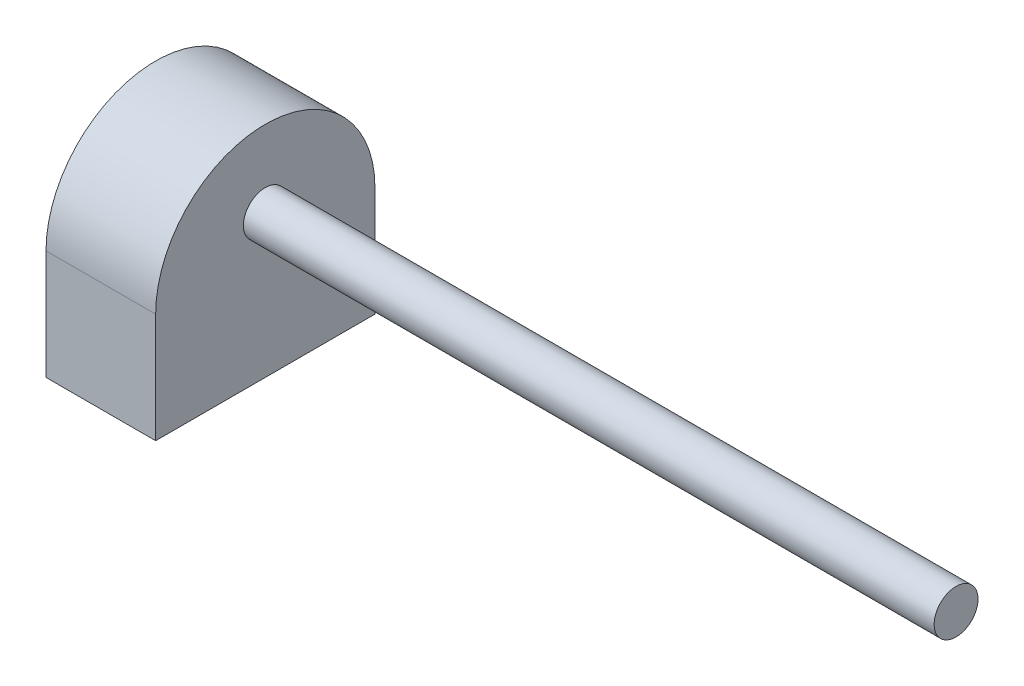
ISO-10303-21;
HEADER;
FILE_DESCRIPTION(('STEP AP214'),'2;1');
FILE_NAME('part.step','',(''),(''),'','','');
FILE_SCHEMA(('AUTOMOTIVE_DESIGN { 1 0 10303 214 1 1 1 1 }'));
ENDSEC;
DATA;
#1=APPLICATION_CONTEXT('core data for automotive mechanical design processes');
#2=APPLICATION_PROTOCOL_DEFINITION('international standard','automotive_design',2000,#1);
#3=PRODUCT_CONTEXT('',#1,'mechanical');
#4=PRODUCT('Part','Part','',(#3));
#5=PRODUCT_RELATED_PRODUCT_CATEGORY('part','',(#4));
#6=PRODUCT_DEFINITION_FORMATION('','',#4);
#7=PRODUCT_DEFINITION_CONTEXT('part definition',#1,'design');
#8=PRODUCT_DEFINITION('design','',#6,#7);
#9=PRODUCT_DEFINITION_SHAPE('','',#8);
#10=(LENGTH_UNIT() NAMED_UNIT(*) SI_UNIT(.MILLI.,.METRE.));
#11=(NAMED_UNIT(*) PLANE_ANGLE_UNIT() SI_UNIT($,.RADIAN.));
#12=(NAMED_UNIT(*) SI_UNIT($,.STERADIAN.) SOLID_ANGLE_UNIT());
#13=UNCERTAINTY_MEASURE_WITH_UNIT(LENGTH_MEASURE(1.E-05),#10,'distance_accuracy_value','');
#14=(GEOMETRIC_REPRESENTATION_CONTEXT(3) GLOBAL_UNCERTAINTY_ASSIGNED_CONTEXT((#13)) GLOBAL_UNIT_ASSIGNED_CONTEXT((#10,
#11,#12)) REPRESENTATION_CONTEXT('',''));
#15=CARTESIAN_POINT('',(0.,0.,0.));
#16=DIRECTION('',(0.,0.,1.));
#17=DIRECTION('',(1.,0.,0.));
#18=AXIS2_PLACEMENT_3D('',#15,#16,#17);
#19=CARTESIAN_POINT('',(0.,10.,-10.));
#20=DIRECTION('',(1.,0.,0.));
#21=DIRECTION('',(0.,0.,-1.));
#22=AXIS2_PLACEMENT_3D('',#19,#20,#21);
#23=CYLINDRICAL_SURFACE('',#22,10.);
#24=DIRECTION('',(-1.,0.,0.));
#25=VECTOR('',#24,1.);
#26=CARTESIAN_POINT('',(0.,10.,0.));
#27=LINE('',#26,#25);
#28=CARTESIAN_POINT('',(0.,10.,0.));
#29=VERTEX_POINT('',#28);
#30=CARTESIAN_POINT('',(-9.99999999999999,10.,0.));
#31=VERTEX_POINT('',#30);
#32=EDGE_CURVE('E92',#29,#31,#27,.T.);
#33=ORIENTED_EDGE('',*,*,#32,.F.);
#34=CARTESIAN_POINT('',(0.,10.,-10.));
#35=DIRECTION('',(-1.,0.,0.));
#36=DIRECTION('',(0.,0.,1.));
#37=AXIS2_PLACEMENT_3D('',#34,#35,#36);
#38=CIRCLE('',#37,10.);
#39=CARTESIAN_POINT('',(0.,10.,-20.));
#40=VERTEX_POINT('',#39);
#41=EDGE_CURVE('E56',#40,#29,#38,.F.);
#42=ORIENTED_EDGE('',*,*,#41,.F.);
#43=DIRECTION('',(-1.,0.,0.));
#44=VECTOR('',#43,1.);
#45=CARTESIAN_POINT('',(0.,10.,-20.));
#46=LINE('',#45,#44);
#47=CARTESIAN_POINT('',(-9.99999999999999,10.,-20.));
#48=VERTEX_POINT('',#47);
#49=EDGE_CURVE('E135',#48,#40,#46,.F.);
#50=ORIENTED_EDGE('',*,*,#49,.F.);
#51=CARTESIAN_POINT('',(-9.99999999999999,10.,-10.));
#52=DIRECTION('',(1.,0.,0.));
#53=DIRECTION('',(0.,0.,-1.));
#54=AXIS2_PLACEMENT_3D('',#51,#52,#53);
#55=CIRCLE('',#54,10.);
#56=EDGE_CURVE('E11',#31,#48,#55,.F.);
#57=ORIENTED_EDGE('',*,*,#56,.F.);
#58=EDGE_LOOP('',(#33,#42,#50,#57));
#59=FACE_BOUND('',#58,.T.);
#60=ADVANCED_FACE('F47',(#59),#23,.T.);
#61=CARTESIAN_POINT('',(-9.99999999999999,20.,-20.));
#62=DIRECTION('',(1.,0.,0.));
#63=DIRECTION('',(0.,0.,-1.));
#64=AXIS2_PLACEMENT_3D('',#61,#62,#63);
#65=PLANE('',#64);
#66=DIRECTION('',(0.,-1.,0.));
#67=VECTOR('',#66,1.);
#68=CARTESIAN_POINT('',(-9.99999999999999,20.,0.));
#69=LINE('',#68,#67);
#70=CARTESIAN_POINT('',(-9.99999999999999,0.,0.));
#71=VERTEX_POINT('',#70);
#72=EDGE_CURVE('E86',#31,#71,#69,.T.);
#73=ORIENTED_EDGE('',*,*,#72,.F.);
#74=ORIENTED_EDGE('',*,*,#56,.T.);
#75=DIRECTION('',(0.,-1.,0.));
#76=VECTOR('',#75,1.);
#77=CARTESIAN_POINT('',(-9.99999999999999,20.,-20.));
#78=LINE('',#77,#76);
#79=CARTESIAN_POINT('',(-9.99999999999999,0.,-20.));
#80=VERTEX_POINT('',#79);
#81=EDGE_CURVE('E109',#48,#80,#78,.T.);
#82=ORIENTED_EDGE('',*,*,#81,.T.);
#83=DIRECTION('',(0.,0.,1.));
#84=VECTOR('',#83,1.);
#85=CARTESIAN_POINT('',(-9.99999999999999,0.,-20.));
#86=LINE('',#85,#84);
#87=EDGE_CURVE('E102',#80,#71,#86,.T.);
#88=ORIENTED_EDGE('',*,*,#87,.T.);
#89=EDGE_LOOP('',(#73,#74,#82,#88));
#90=FACE_BOUND('',#89,.T.);
#91=ADVANCED_FACE('F107',(#90),#65,.F.);
#92=CARTESIAN_POINT('',(-9.99999999999999,20.,0.));
#93=DIRECTION('',(0.,0.,-1.));
#94=DIRECTION('',(-1.,0.,0.));
#95=AXIS2_PLACEMENT_3D('',#92,#93,#94);
#96=PLANE('',#95);
#97=DIRECTION('',(0.,-1.,0.));
#98=VECTOR('',#97,1.);
#99=CARTESIAN_POINT('',(0.,20.,0.));
#100=LINE('',#99,#98);
#101=CARTESIAN_POINT('',(0.,0.,0.));
#102=VERTEX_POINT('',#101);
#103=EDGE_CURVE('E96',#29,#102,#100,.T.);
#104=ORIENTED_EDGE('',*,*,#103,.F.);
#105=ORIENTED_EDGE('',*,*,#32,.T.);
#106=ORIENTED_EDGE('',*,*,#72,.T.);
#107=DIRECTION('',(1.,0.,0.));
#108=VECTOR('',#107,1.);
#109=CARTESIAN_POINT('',(-9.99999999999999,0.,0.));
#110=LINE('',#109,#108);
#111=EDGE_CURVE('E90',#71,#102,#110,.T.);
#112=ORIENTED_EDGE('',*,*,#111,.T.);
#113=EDGE_LOOP('',(#104,#105,#106,#112));
#114=FACE_BOUND('',#113,.T.);
#115=ADVANCED_FACE('F89',(#114),#96,.F.);
#116=CARTESIAN_POINT('',(0.,20.,-20.));
#117=DIRECTION('',(-1.,0.,0.));
#118=DIRECTION('',(0.,0.,1.));
#119=AXIS2_PLACEMENT_3D('',#116,#117,#118);
#120=PLANE('',#119);
#121=CARTESIAN_POINT('',(0.,13.,-10.));
#122=DIRECTION('',(-1.,0.,0.));
#123=DIRECTION('',(0.,0.,1.));
#124=AXIS2_PLACEMENT_3D('',#121,#122,#123);
#125=CIRCLE('',#124,2.);
#126=CARTESIAN_POINT('',(0.,13.,-8.));
#127=VERTEX_POINT('',#126);
#128=EDGE_CURVE('E95',#127,#127,#125,.F.);
#129=ORIENTED_EDGE('',*,*,#128,.F.);
#130=EDGE_LOOP('',(#129));
#131=FACE_BOUND('',#130,.T.);
#132=DIRECTION('',(0.,-1.,0.));
#133=VECTOR('',#132,1.);
#134=CARTESIAN_POINT('',(0.,20.,-20.));
#135=LINE('',#134,#133);
#136=CARTESIAN_POINT('',(0.,0.,-20.));
#137=VERTEX_POINT('',#136);
#138=EDGE_CURVE('E125',#40,#137,#135,.T.);
#139=ORIENTED_EDGE('',*,*,#138,.F.);
#140=ORIENTED_EDGE('',*,*,#41,.T.);
#141=ORIENTED_EDGE('',*,*,#103,.T.);
#142=DIRECTION('',(0.,0.,-1.));
#143=VECTOR('',#142,1.);
#144=CARTESIAN_POINT('',(0.,0.,-20.));
#145=LINE('',#144,#143);
#146=EDGE_CURVE('E104',#102,#137,#145,.T.);
#147=ORIENTED_EDGE('',*,*,#146,.T.);
#148=EDGE_LOOP('',(#139,#140,#141,#147));
#149=FACE_BOUND('',#148,.T.);
#150=ADVANCED_FACE('F140',(#131,#149),#120,.F.);
#151=CARTESIAN_POINT('',(-9.99999999999999,20.,-20.));
#152=DIRECTION('',(0.,0.,1.));
#153=DIRECTION('',(1.,0.,0.));
#154=AXIS2_PLACEMENT_3D('',#151,#152,#153);
#155=PLANE('',#154);
#156=ORIENTED_EDGE('',*,*,#81,.F.);
#157=ORIENTED_EDGE('',*,*,#49,.T.);
#158=ORIENTED_EDGE('',*,*,#138,.T.);
#159=DIRECTION('',(-1.,0.,0.));
#160=VECTOR('',#159,1.);
#161=CARTESIAN_POINT('',(-9.99999999999999,0.,-20.));
#162=LINE('',#161,#160);
#163=EDGE_CURVE('E120',#137,#80,#162,.T.);
#164=ORIENTED_EDGE('',*,*,#163,.T.);
#165=EDGE_LOOP('',(#156,#157,#158,#164));
#166=FACE_BOUND('',#165,.T.);
#167=ADVANCED_FACE('F142',(#166),#155,.F.);
#168=CARTESIAN_POINT('',(0.,0.,0.));
#169=DIRECTION('',(0.,1.,0.));
#170=DIRECTION('',(0.,0.,1.));
#171=AXIS2_PLACEMENT_3D('',#168,#169,#170);
#172=PLANE('',#171);
#173=ORIENTED_EDGE('',*,*,#87,.F.);
#174=ORIENTED_EDGE('',*,*,#163,.F.);
#175=ORIENTED_EDGE('',*,*,#146,.F.);
#176=ORIENTED_EDGE('',*,*,#111,.F.);
#177=EDGE_LOOP('',(#173,#174,#175,#176));
#178=FACE_BOUND('',#177,.T.);
#179=ADVANCED_FACE('F100',(#178),#172,.F.);
#180=CARTESIAN_POINT('',(63.,13.,-10.));
#181=DIRECTION('',(-1.,0.,0.));
#182=DIRECTION('',(0.,0.,1.));
#183=AXIS2_PLACEMENT_3D('',#180,#181,#182);
#184=CYLINDRICAL_SURFACE('',#183,2.);
#185=CARTESIAN_POINT('',(63.,13.,-10.));
#186=DIRECTION('',(1.,0.,0.));
#187=DIRECTION('',(0.,0.,-1.));
#188=AXIS2_PLACEMENT_3D('',#185,#186,#187);
#189=CIRCLE('',#188,2.);
#190=CARTESIAN_POINT('',(63.,13.,-12.));
#191=VERTEX_POINT('',#190);
#192=EDGE_CURVE('E112',#191,#191,#189,.T.);
#193=ORIENTED_EDGE('',*,*,#192,.F.);
#194=EDGE_LOOP('',(#193));
#195=FACE_BOUND('',#194,.T.);
#196=ORIENTED_EDGE('',*,*,#128,.T.);
#197=EDGE_LOOP('',(#196));
#198=FACE_BOUND('',#197,.T.);
#199=ADVANCED_FACE('F149',(#195,#198),#184,.T.);
#200=CARTESIAN_POINT('',(63.,13.,-10.));
#201=DIRECTION('',(1.,0.,0.));
#202=DIRECTION('',(0.,0.,-1.));
#203=AXIS2_PLACEMENT_3D('',#200,#201,#202);
#204=PLANE('',#203);
#205=ORIENTED_EDGE('',*,*,#192,.T.);
#206=EDGE_LOOP('',(#205));
#207=FACE_BOUND('',#206,.T.);
#208=ADVANCED_FACE('F189',(#207),#204,.T.);
#209=CLOSED_SHELL('',(#60,#91,#115,#150,#167,#179,#199,#208));
#210=MANIFOLD_SOLID_BREP('B2',#209);
#211=ADVANCED_BREP_SHAPE_REPRESENTATION('',(#18,#210),#14);
#212=SHAPE_DEFINITION_REPRESENTATION(#9,#211);
ENDSEC;
END-ISO-10303-21;
